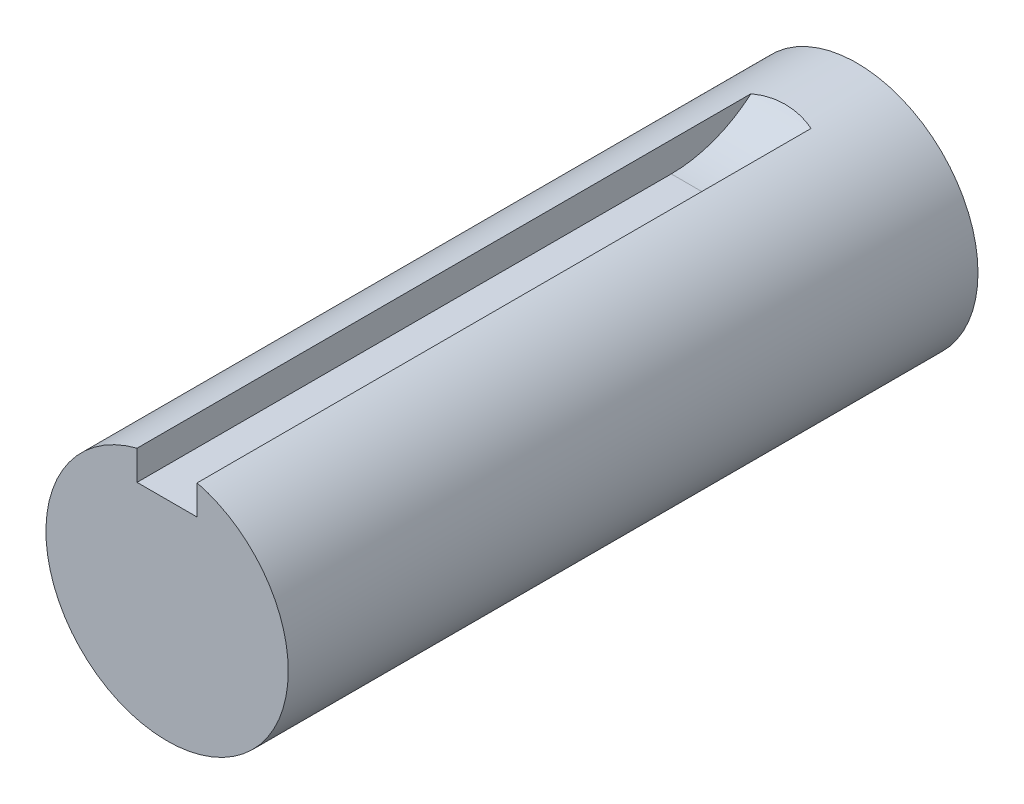
ISO-10303-21;
HEADER;
FILE_DESCRIPTION(('STEP AP214'),'2;1');
FILE_NAME('part.step','',(''),(''),'','','');
FILE_SCHEMA(('AUTOMOTIVE_DESIGN { 1 0 10303 214 1 1 1 1 }'));
ENDSEC;
DATA;
#1=APPLICATION_CONTEXT('core data for automotive mechanical design processes');
#2=APPLICATION_PROTOCOL_DEFINITION('international standard','automotive_design',2000,#1);
#3=PRODUCT_CONTEXT('',#1,'mechanical');
#4=PRODUCT('Part','Part','',(#3));
#5=PRODUCT_RELATED_PRODUCT_CATEGORY('part','',(#4));
#6=PRODUCT_DEFINITION_FORMATION('','',#4);
#7=PRODUCT_DEFINITION_CONTEXT('part definition',#1,'design');
#8=PRODUCT_DEFINITION('design','',#6,#7);
#9=PRODUCT_DEFINITION_SHAPE('','',#8);
#10=(LENGTH_UNIT() NAMED_UNIT(*) SI_UNIT(.MILLI.,.METRE.));
#11=(NAMED_UNIT(*) PLANE_ANGLE_UNIT() SI_UNIT($,.RADIAN.));
#12=(NAMED_UNIT(*) SI_UNIT($,.STERADIAN.) SOLID_ANGLE_UNIT());
#13=UNCERTAINTY_MEASURE_WITH_UNIT(LENGTH_MEASURE(1.E-05),#10,'distance_accuracy_value','');
#14=(GEOMETRIC_REPRESENTATION_CONTEXT(3) GLOBAL_UNCERTAINTY_ASSIGNED_CONTEXT((#13)) GLOBAL_UNIT_ASSIGNED_CONTEXT((#10,
#11,#12)) REPRESENTATION_CONTEXT('',''));
#15=CARTESIAN_POINT('',(0.,0.,0.));
#16=DIRECTION('',(0.,0.,1.));
#17=DIRECTION('',(1.,0.,0.));
#18=AXIS2_PLACEMENT_3D('',#15,#16,#17);
#19=CARTESIAN_POINT('',(0.,0.,55.05));
#20=DIRECTION('',(0.,0.,1.));
#21=DIRECTION('',(1.,0.,0.));
#22=AXIS2_PLACEMENT_3D('',#19,#20,#21);
#23=CYLINDRICAL_SURFACE('',#22,12.7);
#24=CARTESIAN_POINT('',(-3.15000000000007,12.3031500031496,62.9946962868737));
#25=CARTESIAN_POINT('',(-3.03715076353007,12.3320447282953,62.961165239856));
#26=CARTESIAN_POINT('',(-2.92336423784515,12.3595210961178,62.929625431842));
#27=CARTESIAN_POINT('',(-2.69411280368641,12.4115093969487,62.8704712636796));
#28=CARTESIAN_POINT('',(-2.57864798749261,12.4360214922608,62.8428566885975));
#29=CARTESIAN_POINT('',(-2.23009580629848,12.5049077035106,62.7658286968113));
#30=CARTESIAN_POINT('',(-1.9947687173992,12.5446528498244,62.7222068193395));
#31=CARTESIAN_POINT('',(-1.51960932318564,12.6110452573872,62.6500037611275));
#32=CARTESIAN_POINT('',(-1.27976993150883,12.6376697523587,62.6214487175553));
#33=CARTESIAN_POINT('',(-0.797661114065475,12.6772325830456,62.5792048581549));
#34=CARTESIAN_POINT('',(-0.555391700310244,12.690170986376,62.5655159688814));
#35=CARTESIAN_POINT('',(-0.0701320988641542,12.7021254827613,62.5528638183077));
#36=CARTESIAN_POINT('',(0.172858082270144,12.7011417020753,62.5539004234632));
#37=CARTESIAN_POINT('',(0.657873182107817,12.6852697333093,62.5707099434238));
#38=CARTESIAN_POINT('',(0.899898117236525,12.6703817828553,62.5864826063857));
#39=CARTESIAN_POINT('',(1.38070533864779,12.627026150626,62.6328695219557));
#40=CARTESIAN_POINT('',(1.61949394019715,12.5985906688519,62.6634485852578));
#41=CARTESIAN_POINT('',(2.09260709065548,12.5286914363855,62.7397158871403));
#42=CARTESIAN_POINT('',(2.32693421031976,12.4872354450212,62.7853951279028));
#43=CARTESIAN_POINT('',(2.65808000285973,12.4191400815861,62.8618868955368));
#44=CARTESIAN_POINT('',(2.75742568568933,12.3974541079511,62.886412759163));
#45=CARTESIAN_POINT('',(2.95474511084515,12.3519116376076,62.9383663281386));
#46=CARTESIAN_POINT('',(3.05272008302876,12.3280572527394,62.9657912142495));
#47=CARTESIAN_POINT('',(3.14999999999994,12.3031500031496,62.9946962868737));
#48=B_SPLINE_CURVE_WITH_KNOTS('',3,(#24,#25,#26,#27,#28,#29,#30,#31,#32,#33,#34,#35,#36,#37,#38,
#39,#40,#41,#42,#43,#44,#45,#46,#47),.UNSPECIFIED.,.F.,.F.,(4,2,2,2,2,2,2,2,2,2,2,4),(0.,
0.363598784901575,0.727177652561607,1.45407210060369,2.18222341605593,2.91037113411031,
3.63851224865655,4.36664091929654,5.09304753015986,5.81902207139584,6.13276589496856,
6.44620736829289),.UNSPECIFIED.);
#49=CARTESIAN_POINT('',(-3.15,12.3031500031496,62.9946962868737));
#50=VERTEX_POINT('',#49);
#51=CARTESIAN_POINT('',(3.15,12.3031500031496,62.9946962868737));
#52=VERTEX_POINT('',#51);
#53=EDGE_CURVE('E59',#50,#52,#48,.T.);
#54=ORIENTED_EDGE('',*,*,#53,.T.);
#55=DIRECTION('',(0.,0.,1.));
#56=VECTOR('',#55,1.);
#57=CARTESIAN_POINT('',(3.15,12.3031500031496,55.05));
#58=LINE('',#57,#56);
#59=CARTESIAN_POINT('',(3.15,12.3031500031496,127.35));
#60=VERTEX_POINT('',#59);
#61=EDGE_CURVE('E41',#52,#60,#58,.T.);
#62=ORIENTED_EDGE('',*,*,#61,.T.);
#63=CARTESIAN_POINT('',(0.,0.,127.35));
#64=DIRECTION('',(0.,0.,1.));
#65=DIRECTION('',(1.,0.,0.));
#66=AXIS2_PLACEMENT_3D('',#63,#64,#65);
#67=CIRCLE('',#66,12.7);
#68=CARTESIAN_POINT('',(-3.15,12.3031500031496,127.35));
#69=VERTEX_POINT('',#68);
#70=EDGE_CURVE('E21',#69,#60,#67,.T.);
#71=ORIENTED_EDGE('',*,*,#70,.F.);
#72=DIRECTION('',(0.,0.,1.));
#73=VECTOR('',#72,1.);
#74=CARTESIAN_POINT('',(-3.15,12.3031500031496,55.05));
#75=LINE('',#74,#73);
#76=EDGE_CURVE('E33',#69,#50,#75,.F.);
#77=ORIENTED_EDGE('',*,*,#76,.T.);
#78=EDGE_LOOP('',(#54,#62,#71,#77));
#79=FACE_BOUND('',#78,.T.);
#80=CARTESIAN_POINT('',(0.,0.,55.05));
#81=DIRECTION('',(0.,0.,1.));
#82=DIRECTION('',(1.,0.,0.));
#83=AXIS2_PLACEMENT_3D('',#80,#81,#82);
#84=CIRCLE('',#83,12.7);
#85=CARTESIAN_POINT('',(12.7,0.,55.05));
#86=VERTEX_POINT('',#85);
#87=EDGE_CURVE('E11',#86,#86,#84,.T.);
#88=ORIENTED_EDGE('',*,*,#87,.T.);
#89=EDGE_LOOP('',(#88));
#90=FACE_BOUND('',#89,.T.);
#91=ADVANCED_FACE('F17',(#79,#90),#23,.T.);
#92=CARTESIAN_POINT('',(0.,0.,55.05));
#93=DIRECTION('',(0.,0.,1.));
#94=DIRECTION('',(1.,0.,0.));
#95=AXIS2_PLACEMENT_3D('',#92,#93,#94);
#96=PLANE('',#95);
#97=ORIENTED_EDGE('',*,*,#87,.F.);
#98=EDGE_LOOP('',(#97));
#99=FACE_BOUND('',#98,.T.);
#100=ADVANCED_FACE('F105',(#99),#96,.F.);
#101=CARTESIAN_POINT('',(0.,0.,127.35));
#102=DIRECTION('',(0.,0.,1.));
#103=DIRECTION('',(1.,0.,0.));
#104=AXIS2_PLACEMENT_3D('',#101,#102,#103);
#105=PLANE('',#104);
#106=DIRECTION('',(0.,-1.,0.));
#107=VECTOR('',#106,1.);
#108=CARTESIAN_POINT('',(-3.15,15.2,127.35));
#109=LINE('',#108,#107);
#110=CARTESIAN_POINT('',(-3.15,9.2,127.35));
#111=VERTEX_POINT('',#110);
#112=EDGE_CURVE('E89',#69,#111,#109,.T.);
#113=ORIENTED_EDGE('',*,*,#112,.F.);
#114=ORIENTED_EDGE('',*,*,#70,.T.);
#115=DIRECTION('',(0.,1.,0.));
#116=VECTOR('',#115,1.);
#117=CARTESIAN_POINT('',(3.15,9.2,127.35));
#118=LINE('',#117,#116);
#119=CARTESIAN_POINT('',(3.15,9.2,127.35));
#120=VERTEX_POINT('',#119);
#121=EDGE_CURVE('E207',#120,#60,#118,.T.);
#122=ORIENTED_EDGE('',*,*,#121,.F.);
#123=DIRECTION('',(1.,0.,0.));
#124=VECTOR('',#123,1.);
#125=CARTESIAN_POINT('',(-3.15,9.2,127.35));
#126=LINE('',#125,#124);
#127=EDGE_CURVE('E204',#111,#120,#126,.T.);
#128=ORIENTED_EDGE('',*,*,#127,.F.);
#129=EDGE_LOOP('',(#113,#114,#122,#128));
#130=FACE_BOUND('',#129,.T.);
#131=ADVANCED_FACE('F104',(#130),#105,.T.);
#132=CARTESIAN_POINT('',(-3.15,15.2,127.35));
#133=DIRECTION('',(1.,0.,0.));
#134=DIRECTION('',(0.,1.,0.));
#135=AXIS2_PLACEMENT_3D('',#132,#133,#134);
#136=PLANE('',#135);
#137=DIRECTION('',(0.,0.,-1.));
#138=VECTOR('',#137,1.);
#139=CARTESIAN_POINT('',(-3.15,9.2,127.35));
#140=LINE('',#139,#138);
#141=CARTESIAN_POINT('',(-3.15,9.2,71.35));
#142=VERTEX_POINT('',#141);
#143=EDGE_CURVE('E76',#142,#111,#140,.F.);
#144=ORIENTED_EDGE('',*,*,#143,.F.);
#145=CARTESIAN_POINT('',(-3.15,22.,71.35));
#146=DIRECTION('',(1.,0.,0.));
#147=DIRECTION('',(0.,1.,0.));
#148=AXIS2_PLACEMENT_3D('',#145,#146,#147);
#149=CIRCLE('',#148,12.8);
#150=EDGE_CURVE('E66',#142,#50,#149,.T.);
#151=ORIENTED_EDGE('',*,*,#150,.T.);
#152=ORIENTED_EDGE('',*,*,#76,.F.);
#153=ORIENTED_EDGE('',*,*,#112,.T.);
#154=EDGE_LOOP('',(#144,#151,#152,#153));
#155=FACE_BOUND('',#154,.T.);
#156=ADVANCED_FACE('F74',(#155),#136,.T.);
#157=CARTESIAN_POINT('',(0.,9.2,127.35));
#158=DIRECTION('',(0.,1.,0.));
#159=DIRECTION('',(-1.,0.,0.));
#160=AXIS2_PLACEMENT_3D('',#157,#158,#159);
#161=PLANE('',#160);
#162=DIRECTION('',(1.,0.,0.));
#163=VECTOR('',#162,1.);
#164=CARTESIAN_POINT('',(0.,9.2,71.35));
#165=LINE('',#164,#163);
#166=CARTESIAN_POINT('',(3.15,9.2,71.35));
#167=VERTEX_POINT('',#166);
#168=EDGE_CURVE('E71',#167,#142,#165,.F.);
#169=ORIENTED_EDGE('',*,*,#168,.T.);
#170=ORIENTED_EDGE('',*,*,#143,.T.);
#171=ORIENTED_EDGE('',*,*,#127,.T.);
#172=DIRECTION('',(0.,0.,-1.));
#173=VECTOR('',#172,1.);
#174=CARTESIAN_POINT('',(3.15,9.2,127.35));
#175=LINE('',#174,#173);
#176=EDGE_CURVE('E208',#167,#120,#175,.F.);
#177=ORIENTED_EDGE('',*,*,#176,.F.);
#178=EDGE_LOOP('',(#169,#170,#171,#177));
#179=FACE_BOUND('',#178,.T.);
#180=ADVANCED_FACE('F97',(#179),#161,.T.);
#181=CARTESIAN_POINT('',(3.15,9.2,127.35));
#182=DIRECTION('',(-1.,0.,0.));
#183=DIRECTION('',(0.,-1.,0.));
#184=AXIS2_PLACEMENT_3D('',#181,#182,#183);
#185=PLANE('',#184);
#186=ORIENTED_EDGE('',*,*,#61,.F.);
#187=CARTESIAN_POINT('',(3.15,22.,71.35));
#188=DIRECTION('',(1.,0.,0.));
#189=DIRECTION('',(0.,1.,0.));
#190=AXIS2_PLACEMENT_3D('',#187,#188,#189);
#191=CIRCLE('',#190,12.8);
#192=EDGE_CURVE('E69',#167,#52,#191,.T.);
#193=ORIENTED_EDGE('',*,*,#192,.F.);
#194=ORIENTED_EDGE('',*,*,#176,.T.);
#195=ORIENTED_EDGE('',*,*,#121,.T.);
#196=EDGE_LOOP('',(#186,#193,#194,#195));
#197=FACE_BOUND('',#196,.T.);
#198=ADVANCED_FACE('F94',(#197),#185,.T.);
#199=CARTESIAN_POINT('',(3.15,22.,71.35));
#200=DIRECTION('',(-1.,0.,0.));
#201=DIRECTION('',(0.,-1.,0.));
#202=AXIS2_PLACEMENT_3D('',#199,#200,#201);
#203=CYLINDRICAL_SURFACE('',#202,12.8);
#204=ORIENTED_EDGE('',*,*,#150,.F.);
#205=ORIENTED_EDGE('',*,*,#168,.F.);
#206=ORIENTED_EDGE('',*,*,#192,.T.);
#207=ORIENTED_EDGE('',*,*,#53,.F.);
#208=EDGE_LOOP('',(#204,#205,#206,#207));
#209=FACE_BOUND('',#208,.T.);
#210=ADVANCED_FACE('F65',(#209),#203,.F.);
#211=CLOSED_SHELL('',(#91,#100,#131,#156,#180,#198,#210));
#212=MANIFOLD_SOLID_BREP('B1',#211);
#213=ADVANCED_BREP_SHAPE_REPRESENTATION('',(#18,#212),#14);
#214=SHAPE_DEFINITION_REPRESENTATION(#9,#213);
ENDSEC;
END-ISO-10303-21;
